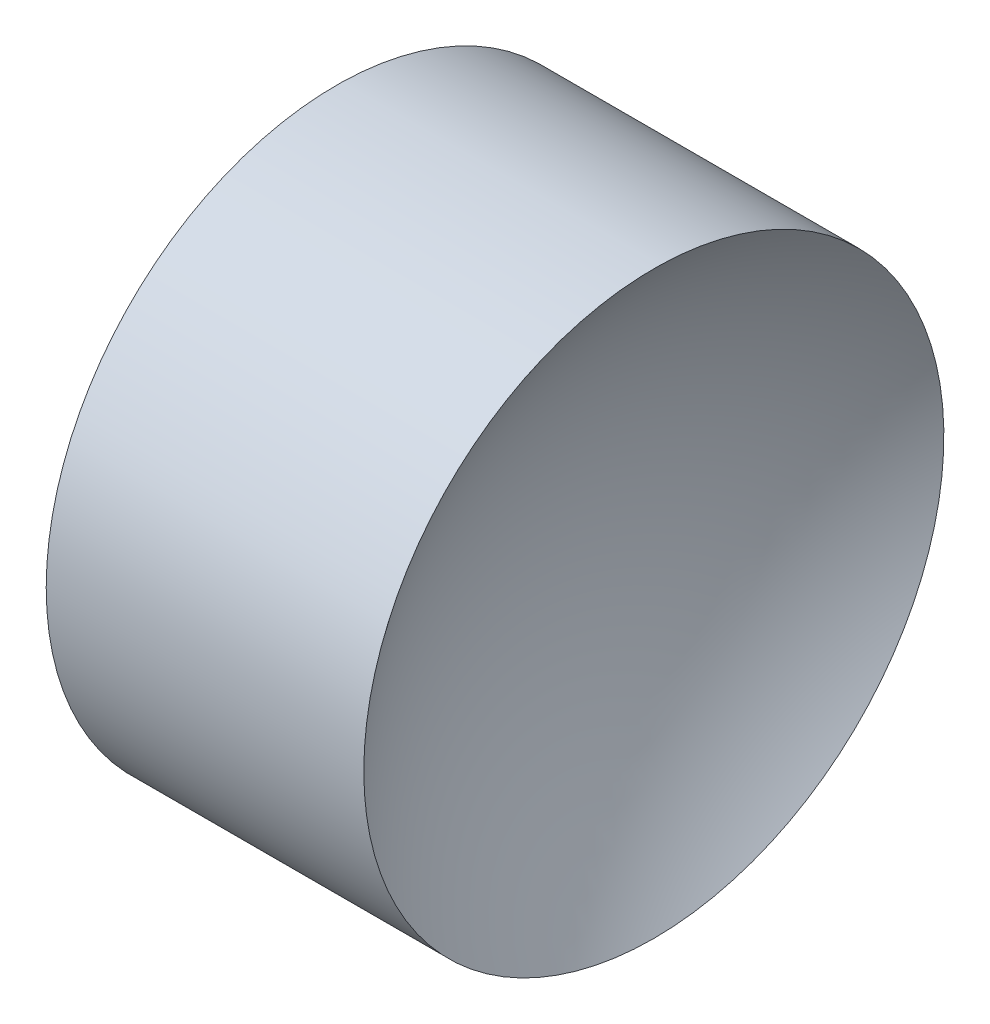
ISO-10303-21;
HEADER;
FILE_DESCRIPTION(('STEP AP214'),'2;1');
FILE_NAME('part.step','',(''),(''),'','','');
FILE_SCHEMA(('AUTOMOTIVE_DESIGN { 1 0 10303 214 1 1 1 1 }'));
ENDSEC;
DATA;
#1=APPLICATION_CONTEXT('core data for automotive mechanical design processes');
#2=APPLICATION_PROTOCOL_DEFINITION('international standard','automotive_design',2000,#1);
#3=PRODUCT_CONTEXT('',#1,'mechanical');
#4=PRODUCT('Part','Part','',(#3));
#5=PRODUCT_RELATED_PRODUCT_CATEGORY('part','',(#4));
#6=PRODUCT_DEFINITION_FORMATION('','',#4);
#7=PRODUCT_DEFINITION_CONTEXT('part definition',#1,'design');
#8=PRODUCT_DEFINITION('design','',#6,#7);
#9=PRODUCT_DEFINITION_SHAPE('','',#8);
#10=(LENGTH_UNIT() NAMED_UNIT(*) SI_UNIT(.MILLI.,.METRE.));
#11=(NAMED_UNIT(*) PLANE_ANGLE_UNIT() SI_UNIT($,.RADIAN.));
#12=(NAMED_UNIT(*) SI_UNIT($,.STERADIAN.) SOLID_ANGLE_UNIT());
#13=UNCERTAINTY_MEASURE_WITH_UNIT(LENGTH_MEASURE(1.E-05),#10,'distance_accuracy_value','');
#14=(GEOMETRIC_REPRESENTATION_CONTEXT(3) GLOBAL_UNCERTAINTY_ASSIGNED_CONTEXT((#13)) GLOBAL_UNIT_ASSIGNED_CONTEXT((#10,
#11,#12)) REPRESENTATION_CONTEXT('',''));
#15=CARTESIAN_POINT('',(0.,0.,0.));
#16=DIRECTION('',(0.,0.,1.));
#17=DIRECTION('',(1.,0.,0.));
#18=AXIS2_PLACEMENT_3D('',#15,#16,#17);
#19=CARTESIAN_POINT('',(15.8264139552067,6.52226028729874,0.));
#20=DIRECTION('',(-1.,0.,0.));
#21=DIRECTION('',(0.,-1.,0.));
#22=AXIS2_PLACEMENT_3D('',#19,#20,#21);
#23=SPHERICAL_SURFACE('',#22,3.24355072463768);
#24=CARTESIAN_POINT('',(13.272863230569,6.52226028729874,0.));
#25=DIRECTION('',(-1.,0.,0.));
#26=DIRECTION('',(0.,0.,1.));
#27=AXIS2_PLACEMENT_3D('',#24,#25,#26);
#28=CIRCLE('',#27,2.);
#29=CARTESIAN_POINT('',(13.272863230569,6.52226028729874,2.));
#30=VERTEX_POINT('',#29);
#31=EDGE_CURVE('E10',#30,#30,#28,.T.);
#32=ORIENTED_EDGE('',*,*,#31,.F.);
#33=EDGE_LOOP('',(#32));
#34=FACE_BOUND('',#33,.T.);
#35=ADVANCED_FACE('F35',(#34),#23,.F.);
#36=CARTESIAN_POINT('',(10.6124652785342,6.52226028729874,0.));
#37=DIRECTION('',(-1.,0.,0.));
#38=DIRECTION('',(0.,0.,1.));
#39=AXIS2_PLACEMENT_3D('',#36,#37,#38);
#40=CYLINDRICAL_SURFACE('',#39,2.);
#41=CARTESIAN_POINT('',(11.082863230569,6.52226028729874,0.));
#42=DIRECTION('',(-1.,0.,0.));
#43=DIRECTION('',(0.,0.,1.));
#44=AXIS2_PLACEMENT_3D('',#41,#42,#43);
#45=CIRCLE('',#44,2.);
#46=CARTESIAN_POINT('',(11.082863230569,6.52226028729874,2.));
#47=VERTEX_POINT('',#46);
#48=EDGE_CURVE('E41',#47,#47,#45,.T.);
#49=ORIENTED_EDGE('',*,*,#48,.F.);
#50=EDGE_LOOP('',(#49));
#51=FACE_BOUND('',#50,.T.);
#52=ORIENTED_EDGE('',*,*,#31,.T.);
#53=EDGE_LOOP('',(#52));
#54=FACE_BOUND('',#53,.T.);
#55=ADVANCED_FACE('F49',(#51,#54),#40,.T.);
#56=CARTESIAN_POINT('',(11.082863230569,6.52226028729874,0.));
#57=DIRECTION('',(1.,0.,0.));
#58=DIRECTION('',(0.,0.,-1.));
#59=AXIS2_PLACEMENT_3D('',#56,#57,#58);
#60=PLANE('',#59);
#61=ORIENTED_EDGE('',*,*,#48,.T.);
#62=EDGE_LOOP('',(#61));
#63=FACE_BOUND('',#62,.T.);
#64=ADVANCED_FACE('F47',(#63),#60,.F.);
#65=CLOSED_SHELL('',(#35,#55,#64));
#66=MANIFOLD_SOLID_BREP('B2',#65);
#67=ADVANCED_BREP_SHAPE_REPRESENTATION('',(#18,#66),#14);
#68=SHAPE_DEFINITION_REPRESENTATION(#9,#67);
ENDSEC;
END-ISO-10303-21;
